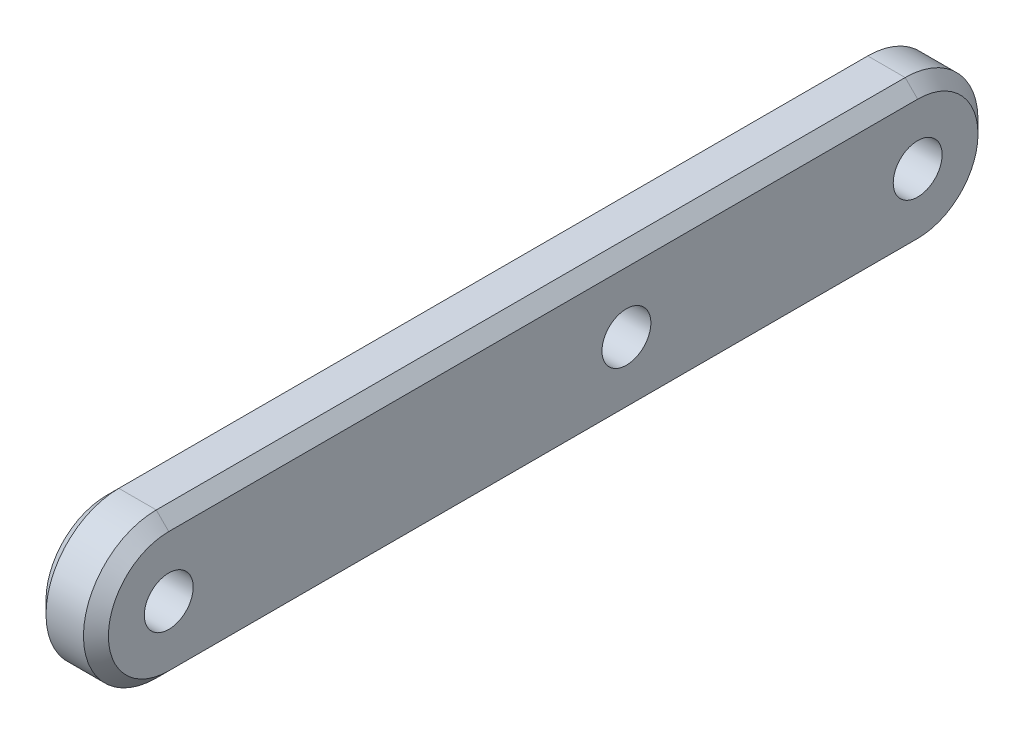
ISO-10303-21;
HEADER;
FILE_DESCRIPTION(('STEP AP214'),'2;1');
FILE_NAME('part.step','',(''),(''),'','','');
FILE_SCHEMA(('AUTOMOTIVE_DESIGN { 1 0 10303 214 1 1 1 1 }'));
ENDSEC;
DATA;
#1=APPLICATION_CONTEXT('core data for automotive mechanical design processes');
#2=APPLICATION_PROTOCOL_DEFINITION('international standard','automotive_design',2000,#1);
#3=PRODUCT_CONTEXT('',#1,'mechanical');
#4=PRODUCT('Part','Part','',(#3));
#5=PRODUCT_RELATED_PRODUCT_CATEGORY('part','',(#4));
#6=PRODUCT_DEFINITION_FORMATION('','',#4);
#7=PRODUCT_DEFINITION_CONTEXT('part definition',#1,'design');
#8=PRODUCT_DEFINITION('design','',#6,#7);
#9=PRODUCT_DEFINITION_SHAPE('','',#8);
#10=(LENGTH_UNIT() NAMED_UNIT(*) SI_UNIT(.MILLI.,.METRE.));
#11=(NAMED_UNIT(*) PLANE_ANGLE_UNIT() SI_UNIT($,.RADIAN.));
#12=(NAMED_UNIT(*) SI_UNIT($,.STERADIAN.) SOLID_ANGLE_UNIT());
#13=UNCERTAINTY_MEASURE_WITH_UNIT(LENGTH_MEASURE(1.E-05),#10,'distance_accuracy_value','');
#14=(GEOMETRIC_REPRESENTATION_CONTEXT(3) GLOBAL_UNCERTAINTY_ASSIGNED_CONTEXT((#13)) GLOBAL_UNIT_ASSIGNED_CONTEXT((#10,
#11,#12)) REPRESENTATION_CONTEXT('',''));
#15=CARTESIAN_POINT('',(0.,0.,0.));
#16=DIRECTION('',(0.,0.,1.));
#17=DIRECTION('',(1.,0.,0.));
#18=AXIS2_PLACEMENT_3D('',#15,#16,#17);
#19=CARTESIAN_POINT('',(1.5,0.,18.));
#20=DIRECTION('',(1.,0.,0.));
#21=DIRECTION('',(0.,0.,-1.));
#22=AXIS2_PLACEMENT_3D('',#19,#20,#21);
#23=PLANE('',#22);
#24=DIRECTION('',(0.,0.,1.));
#25=VECTOR('',#24,1.);
#26=CARTESIAN_POINT('',(1.5,2.9,18.));
#27=LINE('',#26,#25);
#28=CARTESIAN_POINT('',(1.5,2.9,-18.));
#29=VERTEX_POINT('',#28);
#30=CARTESIAN_POINT('',(1.5,2.9,18.));
#31=VERTEX_POINT('',#30);
#32=EDGE_CURVE('E121',#29,#31,#27,.T.);
#33=ORIENTED_EDGE('',*,*,#32,.T.);
#34=CARTESIAN_POINT('',(1.5,0.,18.));
#35=DIRECTION('',(1.,0.,0.));
#36=DIRECTION('',(0.,0.,-1.));
#37=AXIS2_PLACEMENT_3D('',#34,#35,#36);
#38=CIRCLE('',#37,2.9);
#39=CARTESIAN_POINT('',(1.5,-2.9,18.));
#40=VERTEX_POINT('',#39);
#41=EDGE_CURVE('E117',#31,#40,#38,.T.);
#42=ORIENTED_EDGE('',*,*,#41,.T.);
#43=DIRECTION('',(0.,0.,-1.));
#44=VECTOR('',#43,1.);
#45=CARTESIAN_POINT('',(1.5,-2.9,-18.));
#46=LINE('',#45,#44);
#47=CARTESIAN_POINT('',(1.5,-2.9,-18.));
#48=VERTEX_POINT('',#47);
#49=EDGE_CURVE('E111',#40,#48,#46,.T.);
#50=ORIENTED_EDGE('',*,*,#49,.T.);
#51=CARTESIAN_POINT('',(1.5,0.,-18.));
#52=DIRECTION('',(1.,0.,0.));
#53=DIRECTION('',(0.,0.,-1.));
#54=AXIS2_PLACEMENT_3D('',#51,#52,#53);
#55=CIRCLE('',#54,2.9);
#56=EDGE_CURVE('E114',#48,#29,#55,.T.);
#57=ORIENTED_EDGE('',*,*,#56,.T.);
#58=EDGE_LOOP('',(#33,#42,#50,#57));
#59=FACE_BOUND('',#58,.T.);
#60=CARTESIAN_POINT('',(1.5,0.,-18.));
#61=DIRECTION('',(-1.,0.,0.));
#62=DIRECTION('',(0.,0.,1.));
#63=AXIS2_PLACEMENT_3D('',#60,#61,#62);
#64=CIRCLE('',#63,1.175);
#65=CARTESIAN_POINT('',(1.5,0.,-16.825));
#66=VERTEX_POINT('',#65);
#67=EDGE_CURVE('E192',#66,#66,#64,.T.);
#68=ORIENTED_EDGE('',*,*,#67,.T.);
#69=EDGE_LOOP('',(#68));
#70=FACE_BOUND('',#69,.T.);
#71=CARTESIAN_POINT('',(1.5,0.,-4.));
#72=DIRECTION('',(-1.,0.,0.));
#73=DIRECTION('',(0.,0.,1.));
#74=AXIS2_PLACEMENT_3D('',#71,#72,#73);
#75=CIRCLE('',#74,1.175);
#76=CARTESIAN_POINT('',(1.5,0.,-2.825));
#77=VERTEX_POINT('',#76);
#78=EDGE_CURVE('E205',#77,#77,#75,.T.);
#79=ORIENTED_EDGE('',*,*,#78,.T.);
#80=EDGE_LOOP('',(#79));
#81=FACE_BOUND('',#80,.T.);
#82=CARTESIAN_POINT('',(1.5,0.,18.));
#83=DIRECTION('',(-1.,0.,0.));
#84=DIRECTION('',(0.,0.,1.));
#85=AXIS2_PLACEMENT_3D('',#82,#83,#84);
#86=CIRCLE('',#85,1.175);
#87=CARTESIAN_POINT('',(1.5,0.,19.175));
#88=VERTEX_POINT('',#87);
#89=EDGE_CURVE('E138',#88,#88,#86,.T.);
#90=ORIENTED_EDGE('',*,*,#89,.T.);
#91=EDGE_LOOP('',(#90));
#92=FACE_BOUND('',#91,.T.);
#93=ADVANCED_FACE('F43',(#59,#70,#81,#92),#23,.T.);
#94=CARTESIAN_POINT('',(-1.5,0.,18.));
#95=DIRECTION('',(1.,0.,0.));
#96=DIRECTION('',(0.,0.,-1.));
#97=AXIS2_PLACEMENT_3D('',#94,#95,#96);
#98=PLANE('',#97);
#99=CARTESIAN_POINT('',(-1.5,0.,-18.));
#100=DIRECTION('',(1.,0.,0.));
#101=DIRECTION('',(0.,0.,-1.));
#102=AXIS2_PLACEMENT_3D('',#99,#100,#101);
#103=CIRCLE('',#102,2.89999999999999);
#104=CARTESIAN_POINT('',(-1.5,2.89999999999999,-18.));
#105=VERTEX_POINT('',#104);
#106=CARTESIAN_POINT('',(-1.5,-2.89999999999999,-18.));
#107=VERTEX_POINT('',#106);
#108=EDGE_CURVE('E53',#105,#107,#103,.F.);
#109=ORIENTED_EDGE('',*,*,#108,.T.);
#110=DIRECTION('',(0.,0.,1.));
#111=VECTOR('',#110,1.);
#112=CARTESIAN_POINT('',(-1.5,-2.89999999999999,18.));
#113=LINE('',#112,#111);
#114=CARTESIAN_POINT('',(-1.5,-2.89999999999999,18.));
#115=VERTEX_POINT('',#114);
#116=EDGE_CURVE('E11',#107,#115,#113,.T.);
#117=ORIENTED_EDGE('',*,*,#116,.T.);
#118=CARTESIAN_POINT('',(-1.5,0.,18.));
#119=DIRECTION('',(1.,0.,0.));
#120=DIRECTION('',(0.,0.,-1.));
#121=AXIS2_PLACEMENT_3D('',#118,#119,#120);
#122=CIRCLE('',#121,2.89999999999999);
#123=CARTESIAN_POINT('',(-1.5,2.89999999999999,18.));
#124=VERTEX_POINT('',#123);
#125=EDGE_CURVE('E159',#115,#124,#122,.F.);
#126=ORIENTED_EDGE('',*,*,#125,.T.);
#127=DIRECTION('',(0.,0.,-1.));
#128=VECTOR('',#127,1.);
#129=CARTESIAN_POINT('',(-1.5,2.89999999999999,18.));
#130=LINE('',#129,#128);
#131=EDGE_CURVE('E161',#124,#105,#130,.T.);
#132=ORIENTED_EDGE('',*,*,#131,.T.);
#133=EDGE_LOOP('',(#109,#117,#126,#132));
#134=FACE_BOUND('',#133,.T.);
#135=CARTESIAN_POINT('',(-1.5,0.,-18.));
#136=DIRECTION('',(1.,0.,0.));
#137=DIRECTION('',(0.,0.,-1.));
#138=AXIS2_PLACEMENT_3D('',#135,#136,#137);
#139=CIRCLE('',#138,1.175);
#140=CARTESIAN_POINT('',(-1.5,0.,-19.175));
#141=VERTEX_POINT('',#140);
#142=EDGE_CURVE('E182',#141,#141,#139,.T.);
#143=ORIENTED_EDGE('',*,*,#142,.T.);
#144=EDGE_LOOP('',(#143));
#145=FACE_BOUND('',#144,.T.);
#146=CARTESIAN_POINT('',(-1.5,0.,-4.));
#147=DIRECTION('',(1.,0.,0.));
#148=DIRECTION('',(0.,0.,-1.));
#149=AXIS2_PLACEMENT_3D('',#146,#147,#148);
#150=CIRCLE('',#149,1.175);
#151=CARTESIAN_POINT('',(-1.5,0.,-5.175));
#152=VERTEX_POINT('',#151);
#153=EDGE_CURVE('E186',#152,#152,#150,.T.);
#154=ORIENTED_EDGE('',*,*,#153,.T.);
#155=EDGE_LOOP('',(#154));
#156=FACE_BOUND('',#155,.T.);
#157=CARTESIAN_POINT('',(-1.5,0.,18.));
#158=DIRECTION('',(1.,0.,0.));
#159=DIRECTION('',(0.,0.,-1.));
#160=AXIS2_PLACEMENT_3D('',#157,#158,#159);
#161=CIRCLE('',#160,1.175);
#162=CARTESIAN_POINT('',(-1.5,0.,16.825));
#163=VERTEX_POINT('',#162);
#164=EDGE_CURVE('E189',#163,#163,#161,.T.);
#165=ORIENTED_EDGE('',*,*,#164,.T.);
#166=EDGE_LOOP('',(#165));
#167=FACE_BOUND('',#166,.T.);
#168=ADVANCED_FACE('F219',(#134,#145,#156,#167),#98,.F.);
#169=CARTESIAN_POINT('',(1.5,0.,18.));
#170=DIRECTION('',(-1.,0.,0.));
#171=DIRECTION('',(0.,0.,1.));
#172=AXIS2_PLACEMENT_3D('',#169,#170,#171);
#173=CYLINDRICAL_SURFACE('',#172,3.5);
#174=DIRECTION('',(-1.,0.,0.));
#175=VECTOR('',#174,1.);
#176=CARTESIAN_POINT('',(1.5,-3.5,18.));
#177=LINE('',#176,#175);
#178=CARTESIAN_POINT('',(0.899999999999989,-3.5,18.));
#179=VERTEX_POINT('',#178);
#180=CARTESIAN_POINT('',(-0.899999999999993,-3.5,18.));
#181=VERTEX_POINT('',#180);
#182=EDGE_CURVE('E132',#179,#181,#177,.T.);
#183=ORIENTED_EDGE('',*,*,#182,.F.);
#184=CARTESIAN_POINT('',(0.899999999999989,0.,18.));
#185=DIRECTION('',(1.,0.,0.));
#186=DIRECTION('',(0.,0.,-1.));
#187=AXIS2_PLACEMENT_3D('',#184,#185,#186);
#188=CIRCLE('',#187,3.5);
#189=CARTESIAN_POINT('',(0.899999999999989,3.5,18.));
#190=VERTEX_POINT('',#189);
#191=EDGE_CURVE('E175',#179,#190,#188,.F.);
#192=ORIENTED_EDGE('',*,*,#191,.T.);
#193=DIRECTION('',(-1.,0.,0.));
#194=VECTOR('',#193,1.);
#195=CARTESIAN_POINT('',(1.5,3.5,18.));
#196=LINE('',#195,#194);
#197=CARTESIAN_POINT('',(-0.899999999999993,3.5,18.));
#198=VERTEX_POINT('',#197);
#199=EDGE_CURVE('E185',#190,#198,#196,.T.);
#200=ORIENTED_EDGE('',*,*,#199,.T.);
#201=CARTESIAN_POINT('',(-0.899999999999993,0.,18.));
#202=DIRECTION('',(1.,0.,0.));
#203=DIRECTION('',(0.,0.,-1.));
#204=AXIS2_PLACEMENT_3D('',#201,#202,#203);
#205=CIRCLE('',#204,3.5);
#206=EDGE_CURVE('E178',#198,#181,#205,.T.);
#207=ORIENTED_EDGE('',*,*,#206,.T.);
#208=EDGE_LOOP('',(#183,#192,#200,#207));
#209=FACE_BOUND('',#208,.T.);
#210=ADVANCED_FACE('F222',(#209),#173,.T.);
#211=CARTESIAN_POINT('',(1.5,-3.5,18.));
#212=DIRECTION('',(0.,1.,0.));
#213=DIRECTION('',(0.,0.,1.));
#214=AXIS2_PLACEMENT_3D('',#211,#212,#213);
#215=PLANE('',#214);
#216=DIRECTION('',(-1.,0.,0.));
#217=VECTOR('',#216,1.);
#218=CARTESIAN_POINT('',(1.5,-3.5,-18.));
#219=LINE('',#218,#217);
#220=CARTESIAN_POINT('',(0.899999999999989,-3.5,-18.));
#221=VERTEX_POINT('',#220);
#222=CARTESIAN_POINT('',(-0.899999999999993,-3.5,-18.));
#223=VERTEX_POINT('',#222);
#224=EDGE_CURVE('E195',#221,#223,#219,.T.);
#225=ORIENTED_EDGE('',*,*,#224,.F.);
#226=DIRECTION('',(0.,0.,1.));
#227=VECTOR('',#226,1.);
#228=CARTESIAN_POINT('',(0.899999999999989,-3.5,18.));
#229=LINE('',#228,#227);
#230=EDGE_CURVE('E135',#221,#179,#229,.T.);
#231=ORIENTED_EDGE('',*,*,#230,.T.);
#232=ORIENTED_EDGE('',*,*,#182,.T.);
#233=DIRECTION('',(0.,0.,-1.));
#234=VECTOR('',#233,1.);
#235=CARTESIAN_POINT('',(-0.899999999999993,-3.5,18.));
#236=LINE('',#235,#234);
#237=EDGE_CURVE('E172',#181,#223,#236,.T.);
#238=ORIENTED_EDGE('',*,*,#237,.T.);
#239=EDGE_LOOP('',(#225,#231,#232,#238));
#240=FACE_BOUND('',#239,.T.);
#241=ADVANCED_FACE('F250',(#240),#215,.F.);
#242=CARTESIAN_POINT('',(1.5,0.,-18.));
#243=DIRECTION('',(-1.,0.,0.));
#244=DIRECTION('',(0.,0.,1.));
#245=AXIS2_PLACEMENT_3D('',#242,#243,#244);
#246=CYLINDRICAL_SURFACE('',#245,3.5);
#247=DIRECTION('',(-1.,0.,0.));
#248=VECTOR('',#247,1.);
#249=CARTESIAN_POINT('',(1.5,3.5,-18.));
#250=LINE('',#249,#248);
#251=CARTESIAN_POINT('',(0.899999999999989,3.5,-18.));
#252=VERTEX_POINT('',#251);
#253=CARTESIAN_POINT('',(-0.899999999999993,3.5,-18.));
#254=VERTEX_POINT('',#253);
#255=EDGE_CURVE('E198',#252,#254,#250,.T.);
#256=ORIENTED_EDGE('',*,*,#255,.F.);
#257=CARTESIAN_POINT('',(0.899999999999989,0.,-18.));
#258=DIRECTION('',(1.,0.,0.));
#259=DIRECTION('',(0.,0.,-1.));
#260=AXIS2_PLACEMENT_3D('',#257,#258,#259);
#261=CIRCLE('',#260,3.5);
#262=EDGE_CURVE('E163',#252,#221,#261,.F.);
#263=ORIENTED_EDGE('',*,*,#262,.T.);
#264=ORIENTED_EDGE('',*,*,#224,.T.);
#265=CARTESIAN_POINT('',(-0.899999999999993,0.,-18.));
#266=DIRECTION('',(1.,0.,0.));
#267=DIRECTION('',(0.,0.,-1.));
#268=AXIS2_PLACEMENT_3D('',#265,#266,#267);
#269=CIRCLE('',#268,3.5);
#270=EDGE_CURVE('E165',#223,#254,#269,.T.);
#271=ORIENTED_EDGE('',*,*,#270,.T.);
#272=EDGE_LOOP('',(#256,#263,#264,#271));
#273=FACE_BOUND('',#272,.T.);
#274=ADVANCED_FACE('F239',(#273),#246,.T.);
#275=CARTESIAN_POINT('',(1.5,3.5,18.));
#276=DIRECTION('',(0.,-1.,0.));
#277=DIRECTION('',(0.,0.,-1.));
#278=AXIS2_PLACEMENT_3D('',#275,#276,#277);
#279=PLANE('',#278);
#280=ORIENTED_EDGE('',*,*,#199,.F.);
#281=DIRECTION('',(0.,0.,-1.));
#282=VECTOR('',#281,1.);
#283=CARTESIAN_POINT('',(0.899999999999989,3.5,-18.));
#284=LINE('',#283,#282);
#285=EDGE_CURVE('E167',#190,#252,#284,.T.);
#286=ORIENTED_EDGE('',*,*,#285,.T.);
#287=ORIENTED_EDGE('',*,*,#255,.T.);
#288=DIRECTION('',(0.,0.,1.));
#289=VECTOR('',#288,1.);
#290=CARTESIAN_POINT('',(-0.899999999999993,3.5,18.));
#291=LINE('',#290,#289);
#292=EDGE_CURVE('E169',#254,#198,#291,.T.);
#293=ORIENTED_EDGE('',*,*,#292,.T.);
#294=EDGE_LOOP('',(#280,#286,#287,#293));
#295=FACE_BOUND('',#294,.T.);
#296=ADVANCED_FACE('F230',(#295),#279,.F.);
#297=CARTESIAN_POINT('',(1.5,0.,18.));
#298=DIRECTION('',(-1.,0.,0.));
#299=DIRECTION('',(0.,0.,1.));
#300=AXIS2_PLACEMENT_3D('',#297,#298,#299);
#301=CYLINDRICAL_SURFACE('',#300,1.175);
#302=ORIENTED_EDGE('',*,*,#89,.F.);
#303=EDGE_LOOP('',(#302));
#304=FACE_BOUND('',#303,.T.);
#305=ORIENTED_EDGE('',*,*,#164,.F.);
#306=EDGE_LOOP('',(#305));
#307=FACE_BOUND('',#306,.T.);
#308=ADVANCED_FACE('F228',(#304,#307),#301,.F.);
#309=CARTESIAN_POINT('',(1.5,0.,-4.));
#310=DIRECTION('',(-1.,0.,0.));
#311=DIRECTION('',(0.,0.,1.));
#312=AXIS2_PLACEMENT_3D('',#309,#310,#311);
#313=CYLINDRICAL_SURFACE('',#312,1.175);
#314=ORIENTED_EDGE('',*,*,#78,.F.);
#315=EDGE_LOOP('',(#314));
#316=FACE_BOUND('',#315,.T.);
#317=ORIENTED_EDGE('',*,*,#153,.F.);
#318=EDGE_LOOP('',(#317));
#319=FACE_BOUND('',#318,.T.);
#320=ADVANCED_FACE('F215',(#316,#319),#313,.F.);
#321=CARTESIAN_POINT('',(1.5,0.,-18.));
#322=DIRECTION('',(-1.,0.,0.));
#323=DIRECTION('',(0.,0.,1.));
#324=AXIS2_PLACEMENT_3D('',#321,#322,#323);
#325=CYLINDRICAL_SURFACE('',#324,1.175);
#326=ORIENTED_EDGE('',*,*,#67,.F.);
#327=EDGE_LOOP('',(#326));
#328=FACE_BOUND('',#327,.T.);
#329=ORIENTED_EDGE('',*,*,#142,.F.);
#330=EDGE_LOOP('',(#329));
#331=FACE_BOUND('',#330,.T.);
#332=ADVANCED_FACE('F212',(#328,#331),#325,.F.);
#333=CARTESIAN_POINT('',(1.5,0.,-18.));
#334=DIRECTION('',(-1.,0.,0.));
#335=DIRECTION('',(0.,0.,1.));
#336=AXIS2_PLACEMENT_3D('',#333,#334,#335);
#337=CONICAL_SURFACE('',#336,2.9,0.785398163397442);
#338=DIRECTION('',(0.707106781186552,0.707106781186543,0.));
#339=VECTOR('',#338,1.);
#340=CARTESIAN_POINT('',(0.899999999999989,-3.5,-18.));
#341=LINE('',#340,#339);
#342=EDGE_CURVE('E127',#221,#48,#341,.T.);
#343=ORIENTED_EDGE('',*,*,#342,.F.);
#344=ORIENTED_EDGE('',*,*,#262,.F.);
#345=DIRECTION('',(-0.707106781186552,0.707106781186543,0.));
#346=VECTOR('',#345,1.);
#347=CARTESIAN_POINT('',(1.5,2.9,-18.));
#348=LINE('',#347,#346);
#349=EDGE_CURVE('E130',#29,#252,#348,.T.);
#350=ORIENTED_EDGE('',*,*,#349,.F.);
#351=ORIENTED_EDGE('',*,*,#56,.F.);
#352=EDGE_LOOP('',(#343,#344,#350,#351));
#353=FACE_BOUND('',#352,.T.);
#354=ADVANCED_FACE('F125',(#353),#337,.T.);
#355=CARTESIAN_POINT('',(1.5,2.9,18.));
#356=DIRECTION('',(0.707106781186543,0.707106781186552,0.));
#357=DIRECTION('',(0.,0.,-1.));
#358=AXIS2_PLACEMENT_3D('',#355,#356,#357);
#359=PLANE('',#358);
#360=ORIENTED_EDGE('',*,*,#349,.T.);
#361=ORIENTED_EDGE('',*,*,#285,.F.);
#362=DIRECTION('',(-0.707106781186552,0.707106781186543,0.));
#363=VECTOR('',#362,1.);
#364=CARTESIAN_POINT('',(1.5,2.9,18.));
#365=LINE('',#364,#363);
#366=EDGE_CURVE('E136',#31,#190,#365,.T.);
#367=ORIENTED_EDGE('',*,*,#366,.F.);
#368=ORIENTED_EDGE('',*,*,#32,.F.);
#369=EDGE_LOOP('',(#360,#361,#367,#368));
#370=FACE_BOUND('',#369,.T.);
#371=ADVANCED_FACE('F270',(#370),#359,.T.);
#372=CARTESIAN_POINT('',(1.5,-2.9,18.));
#373=DIRECTION('',(0.707106781186543,-0.707106781186552,0.));
#374=DIRECTION('',(0.,0.,1.));
#375=AXIS2_PLACEMENT_3D('',#372,#373,#374);
#376=PLANE('',#375);
#377=ORIENTED_EDGE('',*,*,#342,.T.);
#378=ORIENTED_EDGE('',*,*,#49,.F.);
#379=DIRECTION('',(0.707106781186552,0.707106781186543,0.));
#380=VECTOR('',#379,1.);
#381=CARTESIAN_POINT('',(0.899999999999989,-3.5,18.));
#382=LINE('',#381,#380);
#383=EDGE_CURVE('E140',#179,#40,#382,.T.);
#384=ORIENTED_EDGE('',*,*,#383,.F.);
#385=ORIENTED_EDGE('',*,*,#230,.F.);
#386=EDGE_LOOP('',(#377,#378,#384,#385));
#387=FACE_BOUND('',#386,.T.);
#388=ADVANCED_FACE('F134',(#387),#376,.T.);
#389=CARTESIAN_POINT('',(1.5,0.,18.));
#390=DIRECTION('',(-1.,0.,0.));
#391=DIRECTION('',(0.,0.,1.));
#392=AXIS2_PLACEMENT_3D('',#389,#390,#391);
#393=CONICAL_SURFACE('',#392,2.9,0.785398163397442);
#394=ORIENTED_EDGE('',*,*,#366,.T.);
#395=ORIENTED_EDGE('',*,*,#191,.F.);
#396=ORIENTED_EDGE('',*,*,#383,.T.);
#397=ORIENTED_EDGE('',*,*,#41,.F.);
#398=EDGE_LOOP('',(#394,#395,#396,#397));
#399=FACE_BOUND('',#398,.T.);
#400=ADVANCED_FACE('F259',(#399),#393,.T.);
#401=CARTESIAN_POINT('',(-0.899999999999993,3.5,18.));
#402=DIRECTION('',(0.70710678118655,-0.707106781186546,0.));
#403=DIRECTION('',(0.,0.,1.));
#404=AXIS2_PLACEMENT_3D('',#401,#402,#403);
#405=PLANE('',#404);
#406=DIRECTION('',(0.707106781186546,0.70710678118655,0.));
#407=VECTOR('',#406,1.);
#408=CARTESIAN_POINT('',(-1.5,2.89999999999999,-18.));
#409=LINE('',#408,#407);
#410=EDGE_CURVE('E146',#105,#254,#409,.T.);
#411=ORIENTED_EDGE('',*,*,#410,.F.);
#412=ORIENTED_EDGE('',*,*,#131,.F.);
#413=DIRECTION('',(-0.707106781186546,-0.70710678118655,0.));
#414=VECTOR('',#413,1.);
#415=CARTESIAN_POINT('',(-0.899999999999993,3.5,18.));
#416=LINE('',#415,#414);
#417=EDGE_CURVE('E48',#198,#124,#416,.T.);
#418=ORIENTED_EDGE('',*,*,#417,.F.);
#419=ORIENTED_EDGE('',*,*,#292,.F.);
#420=EDGE_LOOP('',(#411,#412,#418,#419));
#421=FACE_BOUND('',#420,.T.);
#422=ADVANCED_FACE('F46',(#421),#405,.F.);
#423=CARTESIAN_POINT('',(-0.899999999999993,0.,18.));
#424=DIRECTION('',(1.,0.,0.));
#425=DIRECTION('',(0.,0.,-1.));
#426=AXIS2_PLACEMENT_3D('',#423,#424,#425);
#427=CONICAL_SURFACE('',#426,3.5,0.785398163397451);
#428=ORIENTED_EDGE('',*,*,#417,.T.);
#429=ORIENTED_EDGE('',*,*,#125,.F.);
#430=DIRECTION('',(-0.707106781186546,0.70710678118655,0.));
#431=VECTOR('',#430,1.);
#432=CARTESIAN_POINT('',(-0.899999999999993,-3.5,18.));
#433=LINE('',#432,#431);
#434=EDGE_CURVE('E66',#181,#115,#433,.T.);
#435=ORIENTED_EDGE('',*,*,#434,.F.);
#436=ORIENTED_EDGE('',*,*,#206,.F.);
#437=EDGE_LOOP('',(#428,#429,#435,#436));
#438=FACE_BOUND('',#437,.T.);
#439=ADVANCED_FACE('F293',(#438),#427,.T.);
#440=CARTESIAN_POINT('',(-0.899999999999993,0.,-18.));
#441=DIRECTION('',(1.,0.,0.));
#442=DIRECTION('',(0.,0.,-1.));
#443=AXIS2_PLACEMENT_3D('',#440,#441,#442);
#444=CONICAL_SURFACE('',#443,3.5,0.785398163397451);
#445=ORIENTED_EDGE('',*,*,#410,.T.);
#446=ORIENTED_EDGE('',*,*,#270,.F.);
#447=DIRECTION('',(0.707106781186546,-0.70710678118655,0.));
#448=VECTOR('',#447,1.);
#449=CARTESIAN_POINT('',(-1.5,-2.89999999999999,-18.));
#450=LINE('',#449,#448);
#451=EDGE_CURVE('E144',#107,#223,#450,.T.);
#452=ORIENTED_EDGE('',*,*,#451,.F.);
#453=ORIENTED_EDGE('',*,*,#108,.F.);
#454=EDGE_LOOP('',(#445,#446,#452,#453));
#455=FACE_BOUND('',#454,.T.);
#456=ADVANCED_FACE('F288',(#455),#444,.T.);
#457=CARTESIAN_POINT('',(-0.899999999999993,-3.5,18.));
#458=DIRECTION('',(0.70710678118655,0.707106781186546,0.));
#459=DIRECTION('',(0.,0.,-1.));
#460=AXIS2_PLACEMENT_3D('',#457,#458,#459);
#461=PLANE('',#460);
#462=ORIENTED_EDGE('',*,*,#434,.T.);
#463=ORIENTED_EDGE('',*,*,#116,.F.);
#464=ORIENTED_EDGE('',*,*,#451,.T.);
#465=ORIENTED_EDGE('',*,*,#237,.F.);
#466=EDGE_LOOP('',(#462,#463,#464,#465));
#467=FACE_BOUND('',#466,.T.);
#468=ADVANCED_FACE('F282',(#467),#461,.F.);
#469=CLOSED_SHELL('',(#93,#168,#210,#241,#274,#296,#308,#320,#332,#354,#371,#388,#400,#422,#439,
#456,#468));
#470=MANIFOLD_SOLID_BREP('B2',#469);
#471=ADVANCED_BREP_SHAPE_REPRESENTATION('',(#18,#470),#14);
#472=SHAPE_DEFINITION_REPRESENTATION(#9,#471);
ENDSEC;
END-ISO-10303-21;
